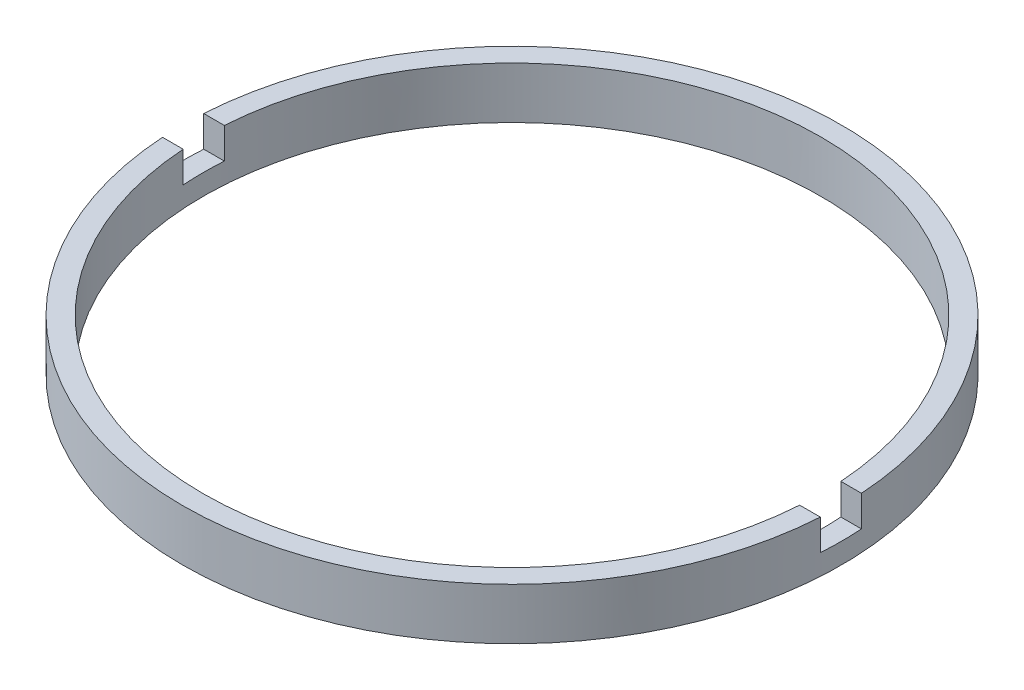
ISO-10303-21;
HEADER;
FILE_DESCRIPTION(('STEP AP214'),'2;1');
FILE_NAME('part.step','',(''),(''),'','','');
FILE_SCHEMA(('AUTOMOTIVE_DESIGN { 1 0 10303 214 1 1 1 1 }'));
ENDSEC;
DATA;
#1=APPLICATION_CONTEXT('core data for automotive mechanical design processes');
#2=APPLICATION_PROTOCOL_DEFINITION('international standard','automotive_design',2000,#1);
#3=PRODUCT_CONTEXT('',#1,'mechanical');
#4=PRODUCT('Part','Part','',(#3));
#5=PRODUCT_RELATED_PRODUCT_CATEGORY('part','',(#4));
#6=PRODUCT_DEFINITION_FORMATION('','',#4);
#7=PRODUCT_DEFINITION_CONTEXT('part definition',#1,'design');
#8=PRODUCT_DEFINITION('design','',#6,#7);
#9=PRODUCT_DEFINITION_SHAPE('','',#8);
#10=(LENGTH_UNIT() NAMED_UNIT(*) SI_UNIT(.MILLI.,.METRE.));
#11=(NAMED_UNIT(*) PLANE_ANGLE_UNIT() SI_UNIT($,.RADIAN.));
#12=(NAMED_UNIT(*) SI_UNIT($,.STERADIAN.) SOLID_ANGLE_UNIT());
#13=UNCERTAINTY_MEASURE_WITH_UNIT(LENGTH_MEASURE(1.E-05),#10,'distance_accuracy_value','');
#14=(GEOMETRIC_REPRESENTATION_CONTEXT(3) GLOBAL_UNCERTAINTY_ASSIGNED_CONTEXT((#13)) GLOBAL_UNIT_ASSIGNED_CONTEXT((#10,
#11,#12)) REPRESENTATION_CONTEXT('',''));
#15=CARTESIAN_POINT('',(0.,0.,0.));
#16=DIRECTION('',(0.,0.,1.));
#17=DIRECTION('',(1.,0.,0.));
#18=AXIS2_PLACEMENT_3D('',#15,#16,#17);
#19=CARTESIAN_POINT('',(15.,-1.96424978717943,0.));
#20=DIRECTION('',(0.,-1.,0.));
#21=DIRECTION('',(0.,0.,-1.));
#22=AXIS2_PLACEMENT_3D('',#19,#20,#21);
#23=PLANE('',#22);
#24=CARTESIAN_POINT('',(0.,-1.96424978717943,0.));
#25=DIRECTION('',(0.,1.,0.));
#26=DIRECTION('',(0.,0.,1.));
#27=AXIS2_PLACEMENT_3D('',#24,#25,#26);
#28=CIRCLE('',#27,16.);
#29=CARTESIAN_POINT('',(-15.9687194226713,-1.96424978717943,1.));
#30=VERTEX_POINT('',#29);
#31=CARTESIAN_POINT('',(15.9687194226713,-1.96424978717943,1.));
#32=VERTEX_POINT('',#31);
#33=EDGE_CURVE('E126',#30,#32,#28,.T.);
#34=ORIENTED_EDGE('',*,*,#33,.T.);
#35=DIRECTION('',(1.,0.,0.));
#36=VECTOR('',#35,1.);
#37=CARTESIAN_POINT('',(-26.8525402726146,-1.96424978717943,1.));
#38=LINE('',#37,#36);
#39=CARTESIAN_POINT('',(14.9666295470958,-1.96424978717943,1.));
#40=VERTEX_POINT('',#39);
#41=EDGE_CURVE('E119',#40,#32,#38,.T.);
#42=ORIENTED_EDGE('',*,*,#41,.F.);
#43=CARTESIAN_POINT('',(0.,-1.96424978717943,0.));
#44=DIRECTION('',(0.,1.,0.));
#45=DIRECTION('',(0.,0.,1.));
#46=AXIS2_PLACEMENT_3D('',#43,#44,#45);
#47=CIRCLE('',#46,15.);
#48=CARTESIAN_POINT('',(-14.9666295470958,-1.96424978717943,1.));
#49=VERTEX_POINT('',#48);
#50=EDGE_CURVE('E133',#49,#40,#47,.T.);
#51=ORIENTED_EDGE('',*,*,#50,.F.);
#52=EDGE_CURVE('E148',#30,#49,#38,.T.);
#53=ORIENTED_EDGE('',*,*,#52,.F.);
#54=EDGE_LOOP('',(#34,#42,#51,#53));
#55=FACE_BOUND('',#54,.T.);
#56=ADVANCED_FACE('F36',(#55),#23,.F.);
#57=CARTESIAN_POINT('',(0.,56.2608426270136,0.));
#58=DIRECTION('',(0.,1.,0.));
#59=DIRECTION('',(0.,0.,1.));
#60=AXIS2_PLACEMENT_3D('',#57,#58,#59);
#61=CYLINDRICAL_SURFACE('',#60,16.);
#62=CARTESIAN_POINT('',(0.,-3.46424978717943,0.));
#63=DIRECTION('',(0.,1.,0.));
#64=DIRECTION('',(0.,0.,1.));
#65=AXIS2_PLACEMENT_3D('',#62,#63,#64);
#66=CIRCLE('',#65,16.);
#67=CARTESIAN_POINT('',(15.9687194226713,-3.46424978717943,1.));
#68=VERTEX_POINT('',#67);
#69=CARTESIAN_POINT('',(15.9687194226713,-3.46424978717943,-1.));
#70=VERTEX_POINT('',#69);
#71=EDGE_CURVE('E109',#68,#70,#66,.T.);
#72=ORIENTED_EDGE('',*,*,#71,.F.);
#73=DIRECTION('',(0.,1.,0.));
#74=VECTOR('',#73,1.);
#75=CARTESIAN_POINT('',(15.9687194226713,56.2608426270136,1.));
#76=LINE('',#75,#74);
#77=EDGE_CURVE('E161',#68,#32,#76,.T.);
#78=ORIENTED_EDGE('',*,*,#77,.T.);
#79=ORIENTED_EDGE('',*,*,#33,.F.);
#80=DIRECTION('',(0.,1.,0.));
#81=VECTOR('',#80,1.);
#82=CARTESIAN_POINT('',(-15.9687194226713,56.2608426270136,1.));
#83=LINE('',#82,#81);
#84=CARTESIAN_POINT('',(-15.9687194226713,-3.46424978717943,1.));
#85=VERTEX_POINT('',#84);
#86=EDGE_CURVE('E158',#30,#85,#83,.F.);
#87=ORIENTED_EDGE('',*,*,#86,.T.);
#88=CARTESIAN_POINT('',(-15.9687194226713,-3.46424978717943,-1.));
#89=VERTEX_POINT('',#88);
#90=EDGE_CURVE('E155',#89,#85,#66,.T.);
#91=ORIENTED_EDGE('',*,*,#90,.F.);
#92=DIRECTION('',(0.,1.,0.));
#93=VECTOR('',#92,1.);
#94=CARTESIAN_POINT('',(-15.9687194226713,56.2608426270136,-1.));
#95=LINE('',#94,#93);
#96=CARTESIAN_POINT('',(-15.9687194226713,-1.96424978717943,-1.));
#97=VERTEX_POINT('',#96);
#98=EDGE_CURVE('E108',#89,#97,#95,.T.);
#99=ORIENTED_EDGE('',*,*,#98,.T.);
#100=CARTESIAN_POINT('',(15.9687194226713,-1.96424978717943,-1.));
#101=VERTEX_POINT('',#100);
#102=EDGE_CURVE('E116',#101,#97,#28,.T.);
#103=ORIENTED_EDGE('',*,*,#102,.F.);
#104=DIRECTION('',(0.,1.,0.));
#105=VECTOR('',#104,1.);
#106=CARTESIAN_POINT('',(15.9687194226713,56.2608426270136,-1.));
#107=LINE('',#106,#105);
#108=EDGE_CURVE('E100',#101,#70,#107,.F.);
#109=ORIENTED_EDGE('',*,*,#108,.T.);
#110=EDGE_LOOP('',(#72,#78,#79,#87,#91,#99,#103,#109));
#111=FACE_BOUND('',#110,.T.);
#112=CARTESIAN_POINT('',(0.,-4.46424978717943,0.));
#113=DIRECTION('',(0.,1.,0.));
#114=DIRECTION('',(0.,0.,1.));
#115=AXIS2_PLACEMENT_3D('',#112,#113,#114);
#116=CIRCLE('',#115,16.);
#117=CARTESIAN_POINT('',(0.,-4.46424978717943,16.));
#118=VERTEX_POINT('',#117);
#119=EDGE_CURVE('E164',#118,#118,#116,.T.);
#120=ORIENTED_EDGE('',*,*,#119,.T.);
#121=EDGE_LOOP('',(#120));
#122=FACE_BOUND('',#121,.T.);
#123=ADVANCED_FACE('F38',(#111,#122),#61,.T.);
#124=ORIENTED_EDGE('',*,*,#102,.T.);
#125=DIRECTION('',(-1.,0.,0.));
#126=VECTOR('',#125,1.);
#127=CARTESIAN_POINT('',(-26.8525402726146,-1.96424978717943,-1.));
#128=LINE('',#127,#126);
#129=CARTESIAN_POINT('',(-14.9666295470958,-1.96424978717943,-1.));
#130=VERTEX_POINT('',#129);
#131=EDGE_CURVE('E120',#130,#97,#128,.T.);
#132=ORIENTED_EDGE('',*,*,#131,.F.);
#133=CARTESIAN_POINT('',(14.9666295470958,-1.96424978717943,-1.));
#134=VERTEX_POINT('',#133);
#135=EDGE_CURVE('E118',#134,#130,#47,.T.);
#136=ORIENTED_EDGE('',*,*,#135,.F.);
#137=EDGE_CURVE('E103',#101,#134,#128,.T.);
#138=ORIENTED_EDGE('',*,*,#137,.F.);
#139=EDGE_LOOP('',(#124,#132,#136,#138));
#140=FACE_BOUND('',#139,.T.);
#141=ADVANCED_FACE('F114',(#140),#23,.F.);
#142=CARTESIAN_POINT('',(0.,56.2608426270136,0.));
#143=DIRECTION('',(0.,1.,0.));
#144=DIRECTION('',(0.,0.,1.));
#145=AXIS2_PLACEMENT_3D('',#142,#143,#144);
#146=CYLINDRICAL_SURFACE('',#145,15.);
#147=CARTESIAN_POINT('',(0.,-3.46424978717943,0.));
#148=DIRECTION('',(0.,1.,0.));
#149=DIRECTION('',(0.,0.,1.));
#150=AXIS2_PLACEMENT_3D('',#147,#148,#149);
#151=CIRCLE('',#150,15.);
#152=CARTESIAN_POINT('',(-14.9666295470958,-3.46424978717943,1.));
#153=VERTEX_POINT('',#152);
#154=CARTESIAN_POINT('',(-14.9666295470958,-3.46424978717943,-1.));
#155=VERTEX_POINT('',#154);
#156=EDGE_CURVE('E130',#153,#155,#151,.F.);
#157=ORIENTED_EDGE('',*,*,#156,.F.);
#158=DIRECTION('',(0.,1.,0.));
#159=VECTOR('',#158,1.);
#160=CARTESIAN_POINT('',(-14.9666295470958,56.2608426270136,1.));
#161=LINE('',#160,#159);
#162=EDGE_CURVE('E11',#153,#49,#161,.T.);
#163=ORIENTED_EDGE('',*,*,#162,.T.);
#164=ORIENTED_EDGE('',*,*,#50,.T.);
#165=DIRECTION('',(0.,1.,0.));
#166=VECTOR('',#165,1.);
#167=CARTESIAN_POINT('',(14.9666295470958,56.2608426270136,1.));
#168=LINE('',#167,#166);
#169=CARTESIAN_POINT('',(14.9666295470958,-3.46424978717943,1.));
#170=VERTEX_POINT('',#169);
#171=EDGE_CURVE('E137',#40,#170,#168,.F.);
#172=ORIENTED_EDGE('',*,*,#171,.T.);
#173=CARTESIAN_POINT('',(14.9666295470958,-3.46424978717943,-1.));
#174=VERTEX_POINT('',#173);
#175=EDGE_CURVE('E125',#174,#170,#151,.F.);
#176=ORIENTED_EDGE('',*,*,#175,.F.);
#177=DIRECTION('',(0.,1.,0.));
#178=VECTOR('',#177,1.);
#179=CARTESIAN_POINT('',(14.9666295470958,56.2608426270136,-1.));
#180=LINE('',#179,#178);
#181=EDGE_CURVE('E128',#174,#134,#180,.T.);
#182=ORIENTED_EDGE('',*,*,#181,.T.);
#183=ORIENTED_EDGE('',*,*,#135,.T.);
#184=DIRECTION('',(0.,1.,0.));
#185=VECTOR('',#184,1.);
#186=CARTESIAN_POINT('',(-14.9666295470958,56.2608426270136,-1.));
#187=LINE('',#186,#185);
#188=EDGE_CURVE('E44',#130,#155,#187,.F.);
#189=ORIENTED_EDGE('',*,*,#188,.T.);
#190=EDGE_LOOP('',(#157,#163,#164,#172,#176,#182,#183,#189));
#191=FACE_BOUND('',#190,.T.);
#192=CARTESIAN_POINT('',(0.,-4.46424978717943,0.));
#193=DIRECTION('',(0.,1.,0.));
#194=DIRECTION('',(0.,0.,1.));
#195=AXIS2_PLACEMENT_3D('',#192,#193,#194);
#196=CIRCLE('',#195,15.);
#197=CARTESIAN_POINT('',(0.,-4.46424978717943,15.));
#198=VERTEX_POINT('',#197);
#199=EDGE_CURVE('E166',#198,#198,#196,.T.);
#200=ORIENTED_EDGE('',*,*,#199,.F.);
#201=EDGE_LOOP('',(#200));
#202=FACE_BOUND('',#201,.T.);
#203=ADVANCED_FACE('F172',(#191,#202),#146,.F.);
#204=CARTESIAN_POINT('',(15.,-4.46424978717943,0.));
#205=DIRECTION('',(0.,1.,0.));
#206=DIRECTION('',(0.,0.,1.));
#207=AXIS2_PLACEMENT_3D('',#204,#205,#206);
#208=PLANE('',#207);
#209=ORIENTED_EDGE('',*,*,#119,.F.);
#210=EDGE_LOOP('',(#209));
#211=FACE_BOUND('',#210,.T.);
#212=ORIENTED_EDGE('',*,*,#199,.T.);
#213=EDGE_LOOP('',(#212));
#214=FACE_BOUND('',#213,.T.);
#215=ADVANCED_FACE('F202',(#211,#214),#208,.F.);
#216=CARTESIAN_POINT('',(0.,-3.46424978717943,0.));
#217=DIRECTION('',(0.,1.,0.));
#218=DIRECTION('',(0.,0.,1.));
#219=AXIS2_PLACEMENT_3D('',#216,#217,#218);
#220=PLANE('',#219);
#221=ORIENTED_EDGE('',*,*,#71,.T.);
#222=DIRECTION('',(-1.,0.,0.));
#223=VECTOR('',#222,1.);
#224=CARTESIAN_POINT('',(-26.8525402726146,-3.46424978717943,-1.));
#225=LINE('',#224,#223);
#226=EDGE_CURVE('E59',#70,#174,#225,.T.);
#227=ORIENTED_EDGE('',*,*,#226,.T.);
#228=ORIENTED_EDGE('',*,*,#175,.T.);
#229=DIRECTION('',(1.,0.,0.));
#230=VECTOR('',#229,1.);
#231=CARTESIAN_POINT('',(-26.8525402726146,-3.46424978717943,1.));
#232=LINE('',#231,#230);
#233=EDGE_CURVE('E150',#170,#68,#232,.T.);
#234=ORIENTED_EDGE('',*,*,#233,.T.);
#235=EDGE_LOOP('',(#221,#227,#228,#234));
#236=FACE_BOUND('',#235,.T.);
#237=ADVANCED_FACE('F176',(#236),#220,.T.);
#238=CARTESIAN_POINT('',(-26.8525402726146,-3.46424978717943,-1.));
#239=DIRECTION('',(0.,0.,-1.));
#240=DIRECTION('',(-1.,0.,0.));
#241=AXIS2_PLACEMENT_3D('',#238,#239,#240);
#242=PLANE('',#241);
#243=ORIENTED_EDGE('',*,*,#137,.T.);
#244=ORIENTED_EDGE('',*,*,#181,.F.);
#245=ORIENTED_EDGE('',*,*,#226,.F.);
#246=ORIENTED_EDGE('',*,*,#108,.F.);
#247=EDGE_LOOP('',(#243,#244,#245,#246));
#248=FACE_BOUND('',#247,.T.);
#249=ADVANCED_FACE('F102',(#248),#242,.F.);
#250=CARTESIAN_POINT('',(-26.8525402726146,-3.46424978717943,1.));
#251=DIRECTION('',(0.,0.,1.));
#252=DIRECTION('',(1.,0.,0.));
#253=AXIS2_PLACEMENT_3D('',#250,#251,#252);
#254=PLANE('',#253);
#255=ORIENTED_EDGE('',*,*,#233,.F.);
#256=ORIENTED_EDGE('',*,*,#171,.F.);
#257=ORIENTED_EDGE('',*,*,#41,.T.);
#258=ORIENTED_EDGE('',*,*,#77,.F.);
#259=EDGE_LOOP('',(#255,#256,#257,#258));
#260=FACE_BOUND('',#259,.T.);
#261=ADVANCED_FACE('F178',(#260),#254,.F.);
#262=ORIENTED_EDGE('',*,*,#52,.T.);
#263=ORIENTED_EDGE('',*,*,#162,.F.);
#264=EDGE_CURVE('E51',#85,#153,#232,.T.);
#265=ORIENTED_EDGE('',*,*,#264,.F.);
#266=ORIENTED_EDGE('',*,*,#86,.F.);
#267=EDGE_LOOP('',(#262,#263,#265,#266));
#268=FACE_BOUND('',#267,.T.);
#269=ADVANCED_FACE('F184',(#268),#254,.F.);
#270=EDGE_CURVE('E145',#155,#89,#225,.T.);
#271=ORIENTED_EDGE('',*,*,#270,.F.);
#272=ORIENTED_EDGE('',*,*,#188,.F.);
#273=ORIENTED_EDGE('',*,*,#131,.T.);
#274=ORIENTED_EDGE('',*,*,#98,.F.);
#275=EDGE_LOOP('',(#271,#272,#273,#274));
#276=FACE_BOUND('',#275,.T.);
#277=ADVANCED_FACE('F147',(#276),#242,.F.);
#278=ORIENTED_EDGE('',*,*,#90,.T.);
#279=ORIENTED_EDGE('',*,*,#264,.T.);
#280=ORIENTED_EDGE('',*,*,#156,.T.);
#281=ORIENTED_EDGE('',*,*,#270,.T.);
#282=EDGE_LOOP('',(#278,#279,#280,#281));
#283=FACE_BOUND('',#282,.T.);
#284=ADVANCED_FACE('F144',(#283),#220,.T.);
#285=CLOSED_SHELL('',(#56,#123,#141,#203,#215,#237,#249,#261,#269,#277,#284));
#286=MANIFOLD_SOLID_BREP('B2',#285);
#287=ADVANCED_BREP_SHAPE_REPRESENTATION('',(#18,#286),#14);
#288=SHAPE_DEFINITION_REPRESENTATION(#9,#287);
ENDSEC;
END-ISO-10303-21;
